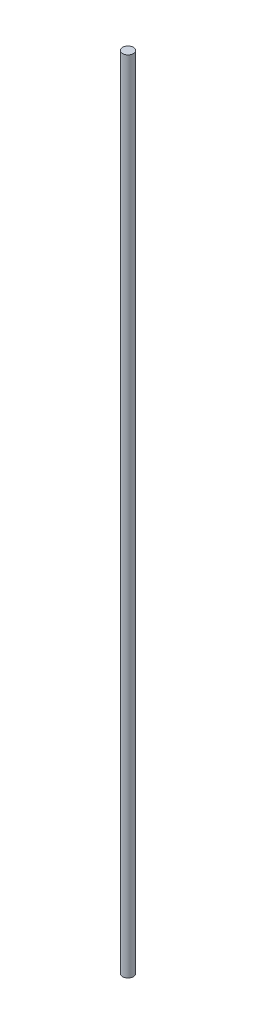
ISO-10303-21;
HEADER;
FILE_DESCRIPTION(('STEP AP214'),'2;1');
FILE_NAME('part.step','',(''),(''),'','','');
FILE_SCHEMA(('AUTOMOTIVE_DESIGN { 1 0 10303 214 1 1 1 1 }'));
ENDSEC;
DATA;
#1=APPLICATION_CONTEXT('core data for automotive mechanical design processes');
#2=APPLICATION_PROTOCOL_DEFINITION('international standard','automotive_design',2000,#1);
#3=PRODUCT_CONTEXT('',#1,'mechanical');
#4=PRODUCT('Part','Part','',(#3));
#5=PRODUCT_RELATED_PRODUCT_CATEGORY('part','',(#4));
#6=PRODUCT_DEFINITION_FORMATION('','',#4);
#7=PRODUCT_DEFINITION_CONTEXT('part definition',#1,'design');
#8=PRODUCT_DEFINITION('design','',#6,#7);
#9=PRODUCT_DEFINITION_SHAPE('','',#8);
#10=(LENGTH_UNIT() NAMED_UNIT(*) SI_UNIT(.MILLI.,.METRE.));
#11=(NAMED_UNIT(*) PLANE_ANGLE_UNIT() SI_UNIT($,.RADIAN.));
#12=(NAMED_UNIT(*) SI_UNIT($,.STERADIAN.) SOLID_ANGLE_UNIT());
#13=UNCERTAINTY_MEASURE_WITH_UNIT(LENGTH_MEASURE(1.E-05),#10,'distance_accuracy_value','');
#14=(GEOMETRIC_REPRESENTATION_CONTEXT(3) GLOBAL_UNCERTAINTY_ASSIGNED_CONTEXT((#13)) GLOBAL_UNIT_ASSIGNED_CONTEXT((#10,
#11,#12)) REPRESENTATION_CONTEXT('',''));
#15=CARTESIAN_POINT('',(0.,0.,0.));
#16=DIRECTION('',(0.,0.,1.));
#17=DIRECTION('',(1.,0.,0.));
#18=AXIS2_PLACEMENT_3D('',#15,#16,#17);
#19=CARTESIAN_POINT('',(0.,73.5,0.));
#20=DIRECTION('',(0.,-1.,0.));
#21=DIRECTION('',(0.,0.,-1.));
#22=AXIS2_PLACEMENT_3D('',#19,#20,#21);
#23=CYLINDRICAL_SURFACE('',#22,1.);
#24=CARTESIAN_POINT('',(0.,73.5,0.));
#25=DIRECTION('',(0.,1.,0.));
#26=DIRECTION('',(0.,0.,1.));
#27=AXIS2_PLACEMENT_3D('',#24,#25,#26);
#28=CIRCLE('',#27,1.);
#29=CARTESIAN_POINT('',(0.,73.5,1.));
#30=VERTEX_POINT('',#29);
#31=EDGE_CURVE('E10',#30,#30,#28,.T.);
#32=ORIENTED_EDGE('',*,*,#31,.F.);
#33=EDGE_LOOP('',(#32));
#34=FACE_BOUND('',#33,.T.);
#35=CARTESIAN_POINT('',(0.,-73.5,0.));
#36=DIRECTION('',(0.,1.,0.));
#37=DIRECTION('',(0.,0.,1.));
#38=AXIS2_PLACEMENT_3D('',#35,#36,#37);
#39=CIRCLE('',#38,1.);
#40=CARTESIAN_POINT('',(0.,-73.5,1.));
#41=VERTEX_POINT('',#40);
#42=EDGE_CURVE('E38',#41,#41,#39,.T.);
#43=ORIENTED_EDGE('',*,*,#42,.T.);
#44=EDGE_LOOP('',(#43));
#45=FACE_BOUND('',#44,.T.);
#46=ADVANCED_FACE('F35',(#34,#45),#23,.T.);
#47=CARTESIAN_POINT('',(0.,73.5,0.));
#48=DIRECTION('',(0.,1.,0.));
#49=DIRECTION('',(0.,0.,1.));
#50=AXIS2_PLACEMENT_3D('',#47,#48,#49);
#51=PLANE('',#50);
#52=ORIENTED_EDGE('',*,*,#31,.T.);
#53=EDGE_LOOP('',(#52));
#54=FACE_BOUND('',#53,.T.);
#55=ADVANCED_FACE('F50',(#54),#51,.T.);
#56=CARTESIAN_POINT('',(0.,-73.5,0.));
#57=DIRECTION('',(0.,1.,0.));
#58=DIRECTION('',(0.,0.,1.));
#59=AXIS2_PLACEMENT_3D('',#56,#57,#58);
#60=PLANE('',#59);
#61=ORIENTED_EDGE('',*,*,#42,.F.);
#62=EDGE_LOOP('',(#61));
#63=FACE_BOUND('',#62,.T.);
#64=ADVANCED_FACE('F48',(#63),#60,.F.);
#65=CLOSED_SHELL('',(#46,#55,#64));
#66=MANIFOLD_SOLID_BREP('B2',#65);
#67=ADVANCED_BREP_SHAPE_REPRESENTATION('',(#18,#66),#14);
#68=SHAPE_DEFINITION_REPRESENTATION(#9,#67);
ENDSEC;
END-ISO-10303-21;
